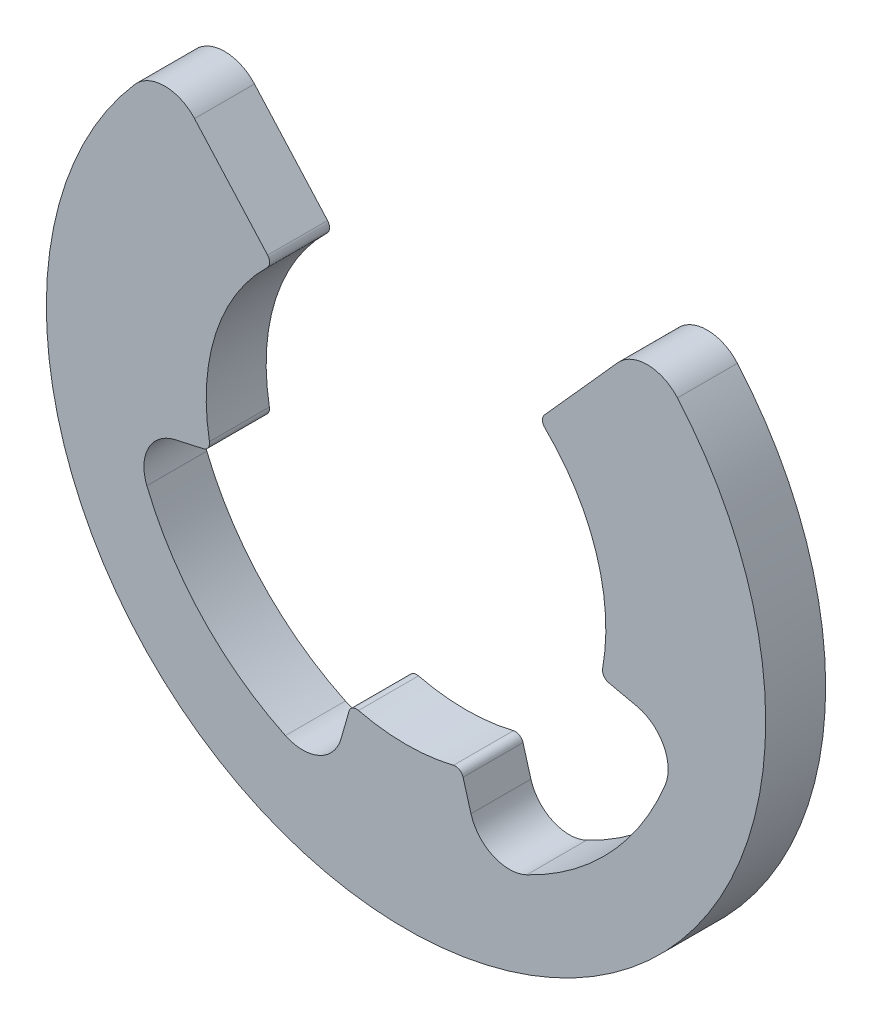
ISO-10303-21;
HEADER;
FILE_DESCRIPTION(('STEP AP214'),'2;1');
FILE_NAME('part.step','',(''),(''),'','','');
FILE_SCHEMA(('AUTOMOTIVE_DESIGN { 1 0 10303 214 1 1 1 1 }'));
ENDSEC;
DATA;
#1=APPLICATION_CONTEXT('core data for automotive mechanical design processes');
#2=APPLICATION_PROTOCOL_DEFINITION('international standard','automotive_design',2000,#1);
#3=PRODUCT_CONTEXT('',#1,'mechanical');
#4=PRODUCT('Part','Part','',(#3));
#5=PRODUCT_RELATED_PRODUCT_CATEGORY('part','',(#4));
#6=PRODUCT_DEFINITION_FORMATION('','',#4);
#7=PRODUCT_DEFINITION_CONTEXT('part definition',#1,'design');
#8=PRODUCT_DEFINITION('design','',#6,#7);
#9=PRODUCT_DEFINITION_SHAPE('','',#8);
#10=(LENGTH_UNIT() NAMED_UNIT(*) SI_UNIT(.MILLI.,.METRE.));
#11=(NAMED_UNIT(*) PLANE_ANGLE_UNIT() SI_UNIT($,.RADIAN.));
#12=(NAMED_UNIT(*) SI_UNIT($,.STERADIAN.) SOLID_ANGLE_UNIT());
#13=UNCERTAINTY_MEASURE_WITH_UNIT(LENGTH_MEASURE(1.E-05),#10,'distance_accuracy_value','');
#14=(GEOMETRIC_REPRESENTATION_CONTEXT(3) GLOBAL_UNCERTAINTY_ASSIGNED_CONTEXT((#13)) GLOBAL_UNIT_ASSIGNED_CONTEXT((#10,
#11,#12)) REPRESENTATION_CONTEXT('',''));
#15=CARTESIAN_POINT('',(0.,0.,0.));
#16=DIRECTION('',(0.,0.,1.));
#17=DIRECTION('',(1.,0.,0.));
#18=AXIS2_PLACEMENT_3D('',#15,#16,#17);
#19=CARTESIAN_POINT('',(3.01842930731455,2.62470655821647,0.75));
#20=DIRECTION('',(0.,0.,-1.));
#21=DIRECTION('',(-1.,0.,0.));
#22=AXIS2_PLACEMENT_3D('',#19,#20,#21);
#23=CYLINDRICAL_SURFACE('',#22,0.500000000000001);
#24=CARTESIAN_POINT('',(3.01842930731455,2.62470655821647,0.));
#25=DIRECTION('',(0.,0.,1.));
#26=DIRECTION('',(-1.,0.,0.));
#27=AXIS2_PLACEMENT_3D('',#24,#25,#26);
#28=CIRCLE('',#27,0.500000000000001);
#29=CARTESIAN_POINT('',(3.39573297072888,2.95279487799353,0.));
#30=VERTEX_POINT('',#29);
#31=CARTESIAN_POINT('',(2.64575131106459,2.95803989154981,0.));
#32=VERTEX_POINT('',#31);
#33=EDGE_CURVE('E229',#30,#32,#28,.T.);
#34=ORIENTED_EDGE('',*,*,#33,.T.);
#35=DIRECTION('',(0.,0.,-1.));
#36=VECTOR('',#35,1.);
#37=CARTESIAN_POINT('',(2.64575131106459,2.95803989154981,0.75));
#38=LINE('',#37,#36);
#39=CARTESIAN_POINT('',(2.64575131106459,2.95803989154981,0.75));
#40=VERTEX_POINT('',#39);
#41=EDGE_CURVE('E11',#40,#32,#38,.T.);
#42=ORIENTED_EDGE('',*,*,#41,.F.);
#43=CARTESIAN_POINT('',(3.01842930731455,2.62470655821647,0.75));
#44=DIRECTION('',(0.,0.,1.));
#45=DIRECTION('',(-1.,0.,0.));
#46=AXIS2_PLACEMENT_3D('',#43,#44,#45);
#47=CIRCLE('',#46,0.500000000000001);
#48=CARTESIAN_POINT('',(3.39573297072888,2.95279487799353,0.75));
#49=VERTEX_POINT('',#48);
#50=EDGE_CURVE('E275',#49,#40,#47,.T.);
#51=ORIENTED_EDGE('',*,*,#50,.F.);
#52=DIRECTION('',(0.,0.,-1.));
#53=VECTOR('',#52,1.);
#54=CARTESIAN_POINT('',(3.39573297072888,2.95279487799353,0.75));
#55=LINE('',#54,#53);
#56=EDGE_CURVE('E225',#49,#30,#55,.T.);
#57=ORIENTED_EDGE('',*,*,#56,.T.);
#58=EDGE_LOOP('',(#34,#42,#51,#57));
#59=FACE_BOUND('',#58,.T.);
#60=ADVANCED_FACE('F37',(#59),#23,.T.);
#61=CARTESIAN_POINT('',(2.64575131106459,2.95803989154981,0.75));
#62=DIRECTION('',(0.745355992499929,-0.666666666666667,0.));
#63=DIRECTION('',(0.666666666666667,0.74535599249993,0.));
#64=AXIS2_PLACEMENT_3D('',#61,#62,#63);
#65=PLANE('',#64);
#66=DIRECTION('',(-0.666666666666667,-0.74535599249993,0.));
#67=VECTOR('',#66,1.);
#68=CARTESIAN_POINT('',(2.64575131106459,2.95803989154981,0.));
#69=LINE('',#68,#67);
#70=CARTESIAN_POINT('',(1.73205080756888,1.93649167310371,0.));
#71=VERTEX_POINT('',#70);
#72=EDGE_CURVE('E232',#32,#71,#69,.T.);
#73=ORIENTED_EDGE('',*,*,#72,.T.);
#74=DIRECTION('',(0.,0.,-1.));
#75=VECTOR('',#74,1.);
#76=CARTESIAN_POINT('',(1.73205080756888,1.93649167310371,0.75));
#77=LINE('',#76,#75);
#78=CARTESIAN_POINT('',(1.73205080756888,1.93649167310371,0.75));
#79=VERTEX_POINT('',#78);
#80=EDGE_CURVE('E45',#79,#71,#77,.T.);
#81=ORIENTED_EDGE('',*,*,#80,.F.);
#82=DIRECTION('',(-0.666666666666667,-0.74535599249993,0.));
#83=VECTOR('',#82,1.);
#84=CARTESIAN_POINT('',(2.64575131106459,2.95803989154981,0.75));
#85=LINE('',#84,#83);
#86=EDGE_CURVE('E144',#40,#79,#85,.T.);
#87=ORIENTED_EDGE('',*,*,#86,.F.);
#88=ORIENTED_EDGE('',*,*,#41,.T.);
#89=EDGE_LOOP('',(#73,#81,#87,#88));
#90=FACE_BOUND('',#89,.T.);
#91=ADVANCED_FACE('F413',(#90),#65,.F.);
#92=CARTESIAN_POINT('',(1.80658640681887,1.86982500643704,0.75));
#93=DIRECTION('',(0.,0.,-1.));
#94=DIRECTION('',(-1.,0.,0.));
#95=AXIS2_PLACEMENT_3D('',#92,#93,#94);
#96=CYLINDRICAL_SURFACE('',#95,0.1);
#97=CARTESIAN_POINT('',(1.80658640681887,1.86982500643704,0.));
#98=DIRECTION('',(0.,0.,1.));
#99=DIRECTION('',(-1.,0.,0.));
#100=AXIS2_PLACEMENT_3D('',#97,#98,#99);
#101=CIRCLE('',#100,0.1);
#102=CARTESIAN_POINT('',(1.73710231424891,1.79790866003562,0.));
#103=VERTEX_POINT('',#102);
#104=EDGE_CURVE('E234',#71,#103,#101,.T.);
#105=ORIENTED_EDGE('',*,*,#104,.T.);
#106=DIRECTION('',(0.,0.,-1.));
#107=VECTOR('',#106,1.);
#108=CARTESIAN_POINT('',(1.73710231424891,1.79790866003562,0.75));
#109=LINE('',#108,#107);
#110=CARTESIAN_POINT('',(1.73710231424891,1.79790866003562,0.75));
#111=VERTEX_POINT('',#110);
#112=EDGE_CURVE('E330',#111,#103,#109,.T.);
#113=ORIENTED_EDGE('',*,*,#112,.F.);
#114=CARTESIAN_POINT('',(1.80658640681887,1.86982500643704,0.75));
#115=DIRECTION('',(0.,0.,1.));
#116=DIRECTION('',(-1.,0.,0.));
#117=AXIS2_PLACEMENT_3D('',#114,#115,#116);
#118=CIRCLE('',#117,0.1);
#119=EDGE_CURVE('E338',#79,#111,#118,.T.);
#120=ORIENTED_EDGE('',*,*,#119,.F.);
#121=ORIENTED_EDGE('',*,*,#80,.T.);
#122=EDGE_LOOP('',(#105,#113,#120,#121));
#123=FACE_BOUND('',#122,.T.);
#124=ADVANCED_FACE('F336',(#123),#96,.T.);
#125=CARTESIAN_POINT('',(0.,0.,0.75));
#126=DIRECTION('',(0.,0.,-1.));
#127=DIRECTION('',(-1.,0.,0.));
#128=AXIS2_PLACEMENT_3D('',#125,#126,#127);
#129=CYLINDRICAL_SURFACE('',#128,2.5);
#130=CARTESIAN_POINT('',(0.,0.,0.));
#131=DIRECTION('',(0.,0.,-1.));
#132=DIRECTION('',(1.,0.,0.));
#133=AXIS2_PLACEMENT_3D('',#130,#131,#132);
#134=CIRCLE('',#133,2.5);
#135=CARTESIAN_POINT('',(2.45952060065069,-0.448060726882923,0.));
#136=VERTEX_POINT('',#135);
#137=EDGE_CURVE('E236',#103,#136,#134,.T.);
#138=ORIENTED_EDGE('',*,*,#137,.T.);
#139=DIRECTION('',(0.,0.,-1.));
#140=VECTOR('',#139,1.);
#141=CARTESIAN_POINT('',(2.45952060065069,-0.448060726882923,0.75));
#142=LINE('',#141,#140);
#143=CARTESIAN_POINT('',(2.45952060065069,-0.448060726882923,0.75));
#144=VERTEX_POINT('',#143);
#145=EDGE_CURVE('E327',#144,#136,#142,.T.);
#146=ORIENTED_EDGE('',*,*,#145,.F.);
#147=CARTESIAN_POINT('',(0.,0.,0.75));
#148=DIRECTION('',(0.,0.,-1.));
#149=DIRECTION('',(1.,0.,0.));
#150=AXIS2_PLACEMENT_3D('',#147,#148,#149);
#151=CIRCLE('',#150,2.5);
#152=EDGE_CURVE('E356',#111,#144,#151,.T.);
#153=ORIENTED_EDGE('',*,*,#152,.F.);
#154=ORIENTED_EDGE('',*,*,#112,.T.);
#155=EDGE_LOOP('',(#138,#146,#153,#154));
#156=FACE_BOUND('',#155,.T.);
#157=ADVANCED_FACE('F347',(#156),#129,.F.);
#158=CARTESIAN_POINT('',(2.55790142467672,-0.465983155958239,0.75));
#159=DIRECTION('',(0.,0.,-1.));
#160=DIRECTION('',(-1.,0.,0.));
#161=AXIS2_PLACEMENT_3D('',#158,#159,#160);
#162=CYLINDRICAL_SURFACE('',#161,0.0999999999999998);
#163=CARTESIAN_POINT('',(2.55790142467672,-0.465983155958239,0.));
#164=DIRECTION('',(0.,0.,1.));
#165=DIRECTION('',(1.,0.,0.));
#166=AXIS2_PLACEMENT_3D('',#163,#164,#165);
#167=CIRCLE('',#166,0.0999999999999998);
#168=CARTESIAN_POINT('',(2.53620837889485,-0.563601861976634,0.));
#169=VERTEX_POINT('',#168);
#170=EDGE_CURVE('E238',#136,#169,#167,.T.);
#171=ORIENTED_EDGE('',*,*,#170,.T.);
#172=DIRECTION('',(0.,0.,-1.));
#173=VECTOR('',#172,1.);
#174=CARTESIAN_POINT('',(2.53620837889485,-0.563601861976634,0.75));
#175=LINE('',#174,#173);
#176=CARTESIAN_POINT('',(2.53620837889485,-0.563601861976634,0.75));
#177=VERTEX_POINT('',#176);
#178=EDGE_CURVE('E324',#177,#169,#175,.T.);
#179=ORIENTED_EDGE('',*,*,#178,.F.);
#180=CARTESIAN_POINT('',(2.55790142467672,-0.465983155958239,0.75));
#181=DIRECTION('',(0.,0.,1.));
#182=DIRECTION('',(1.,0.,0.));
#183=AXIS2_PLACEMENT_3D('',#180,#181,#182);
#184=CIRCLE('',#183,0.0999999999999998);
#185=EDGE_CURVE('E353',#144,#177,#184,.T.);
#186=ORIENTED_EDGE('',*,*,#185,.F.);
#187=ORIENTED_EDGE('',*,*,#145,.T.);
#188=EDGE_LOOP('',(#171,#179,#186,#187));
#189=FACE_BOUND('',#188,.T.);
#190=ADVANCED_FACE('F351',(#189),#162,.T.);
#191=CARTESIAN_POINT('',(2.88760026563887,-0.641688947919748,0.75));
#192=DIRECTION('',(0.216930457818656,0.976187060183953,0.));
#193=DIRECTION('',(-0.976187060183953,0.216930457818656,0.));
#194=AXIS2_PLACEMENT_3D('',#191,#192,#193);
#195=PLANE('',#194);
#196=DIRECTION('',(0.976187060183953,-0.216930457818656,0.));
#197=VECTOR('',#196,1.);
#198=CARTESIAN_POINT('',(2.88760026563887,-0.641688947919748,0.));
#199=LINE('',#198,#197);
#200=CARTESIAN_POINT('',(2.88760026563887,-0.641688947919748,0.));
#201=VERTEX_POINT('',#200);
#202=EDGE_CURVE('E240',#169,#201,#199,.T.);
#203=ORIENTED_EDGE('',*,*,#202,.T.);
#204=DIRECTION('',(0.,0.,-1.));
#205=VECTOR('',#204,1.);
#206=CARTESIAN_POINT('',(2.88760026563887,-0.641688947919748,0.75));
#207=LINE('',#206,#205);
#208=CARTESIAN_POINT('',(2.88760026563887,-0.641688947919748,0.75));
#209=VERTEX_POINT('',#208);
#210=EDGE_CURVE('E321',#209,#201,#207,.T.);
#211=ORIENTED_EDGE('',*,*,#210,.F.);
#212=DIRECTION('',(0.976187060183953,-0.216930457818656,0.));
#213=VECTOR('',#212,1.);
#214=CARTESIAN_POINT('',(2.88760026563887,-0.641688947919748,0.75));
#215=LINE('',#214,#213);
#216=EDGE_CURVE('E355',#177,#209,#215,.T.);
#217=ORIENTED_EDGE('',*,*,#216,.F.);
#218=ORIENTED_EDGE('',*,*,#178,.T.);
#219=EDGE_LOOP('',(#203,#211,#217,#218));
#220=FACE_BOUND('',#219,.T.);
#221=ADVANCED_FACE('F426',(#220),#195,.F.);
#222=CARTESIAN_POINT('',(2.77913503672954,-1.12978247801172,0.75));
#223=DIRECTION('',(0.,0.,-1.));
#224=DIRECTION('',(-1.,0.,0.));
#225=AXIS2_PLACEMENT_3D('',#222,#223,#224);
#226=CYLINDRICAL_SURFACE('',#225,0.5);
#227=CARTESIAN_POINT('',(2.77913503672954,-1.12978247801172,0.));
#228=DIRECTION('',(0.,0.,-1.));
#229=DIRECTION('',(1.,0.,0.));
#230=AXIS2_PLACEMENT_3D('',#227,#228,#229);
#231=CIRCLE('',#230,0.5);
#232=CARTESIAN_POINT('',(3.24232420951779,-1.31807955768035,0.));
#233=VERTEX_POINT('',#232);
#234=EDGE_CURVE('E242',#201,#233,#231,.T.);
#235=ORIENTED_EDGE('',*,*,#234,.T.);
#236=DIRECTION('',(0.,0.,-1.));
#237=VECTOR('',#236,1.);
#238=CARTESIAN_POINT('',(3.24232420951779,-1.31807955768035,0.75));
#239=LINE('',#238,#237);
#240=CARTESIAN_POINT('',(3.24232420951779,-1.31807955768035,0.75));
#241=VERTEX_POINT('',#240);
#242=EDGE_CURVE('E318',#241,#233,#239,.T.);
#243=ORIENTED_EDGE('',*,*,#242,.F.);
#244=CARTESIAN_POINT('',(2.77913503672954,-1.12978247801172,0.75));
#245=DIRECTION('',(0.,0.,-1.));
#246=DIRECTION('',(1.,0.,0.));
#247=AXIS2_PLACEMENT_3D('',#244,#245,#246);
#248=CIRCLE('',#247,0.5);
#249=EDGE_CURVE('E358',#209,#241,#248,.T.);
#250=ORIENTED_EDGE('',*,*,#249,.F.);
#251=ORIENTED_EDGE('',*,*,#210,.T.);
#252=EDGE_LOOP('',(#235,#243,#250,#251));
#253=FACE_BOUND('',#252,.T.);
#254=ADVANCED_FACE('F429',(#253),#226,.F.);
#255=CARTESIAN_POINT('',(0.,0.,0.75));
#256=DIRECTION('',(0.,0.,-1.));
#257=DIRECTION('',(-1.,0.,0.));
#258=AXIS2_PLACEMENT_3D('',#255,#256,#257);
#259=CYLINDRICAL_SURFACE('',#258,3.5);
#260=CARTESIAN_POINT('',(0.,0.,0.));
#261=DIRECTION('',(0.,0.,-1.));
#262=DIRECTION('',(1.,0.,0.));
#263=AXIS2_PLACEMENT_3D('',#260,#261,#262);
#264=CIRCLE('',#263,3.5);
#265=CARTESIAN_POINT('',(1.50896436739115,-3.15800990149553,0.));
#266=VERTEX_POINT('',#265);
#267=EDGE_CURVE('E244',#233,#266,#264,.T.);
#268=ORIENTED_EDGE('',*,*,#267,.T.);
#269=DIRECTION('',(0.,0.,-1.));
#270=VECTOR('',#269,1.);
#271=CARTESIAN_POINT('',(1.50896436739115,-3.15800990149553,0.75));
#272=LINE('',#271,#270);
#273=CARTESIAN_POINT('',(1.50896436739115,-3.15800990149553,0.75));
#274=VERTEX_POINT('',#273);
#275=EDGE_CURVE('E315',#274,#266,#272,.T.);
#276=ORIENTED_EDGE('',*,*,#275,.F.);
#277=CARTESIAN_POINT('',(0.,0.,0.75));
#278=DIRECTION('',(0.,0.,-1.));
#279=DIRECTION('',(1.,0.,0.));
#280=AXIS2_PLACEMENT_3D('',#277,#278,#279);
#281=CIRCLE('',#280,3.5);
#282=EDGE_CURVE('E364',#241,#274,#281,.T.);
#283=ORIENTED_EDGE('',*,*,#282,.F.);
#284=ORIENTED_EDGE('',*,*,#242,.T.);
#285=EDGE_LOOP('',(#268,#276,#283,#284));
#286=FACE_BOUND('',#285,.T.);
#287=ADVANCED_FACE('F433',(#286),#259,.F.);
#288=CARTESIAN_POINT('',(1.29339802919241,-2.70686562985331,0.75));
#289=DIRECTION('',(0.,0.,-1.));
#290=DIRECTION('',(-1.,0.,0.));
#291=AXIS2_PLACEMENT_3D('',#288,#289,#290);
#292=CYLINDRICAL_SURFACE('',#291,0.5);
#293=CARTESIAN_POINT('',(1.29339802919241,-2.70686562985331,0.));
#294=DIRECTION('',(0.,0.,-1.));
#295=DIRECTION('',(-1.,0.,0.));
#296=AXIS2_PLACEMENT_3D('',#293,#294,#295);
#297=CIRCLE('',#296,0.5);
#298=CARTESIAN_POINT('',(0.812636055372002,-2.844226193802,0.));
#299=VERTEX_POINT('',#298);
#300=EDGE_CURVE('E246',#266,#299,#297,.T.);
#301=ORIENTED_EDGE('',*,*,#300,.T.);
#302=DIRECTION('',(0.,0.,-1.));
#303=VECTOR('',#302,1.);
#304=CARTESIAN_POINT('',(0.812636055372002,-2.844226193802,0.75));
#305=LINE('',#304,#303);
#306=CARTESIAN_POINT('',(0.812636055372002,-2.844226193802,0.75));
#307=VERTEX_POINT('',#306);
#308=EDGE_CURVE('E312',#307,#299,#305,.T.);
#309=ORIENTED_EDGE('',*,*,#308,.F.);
#310=CARTESIAN_POINT('',(1.29339802919241,-2.70686562985331,0.75));
#311=DIRECTION('',(0.,0.,-1.));
#312=DIRECTION('',(-1.,0.,0.));
#313=AXIS2_PLACEMENT_3D('',#310,#311,#312);
#314=CIRCLE('',#313,0.5);
#315=EDGE_CURVE('E366',#274,#307,#314,.T.);
#316=ORIENTED_EDGE('',*,*,#315,.F.);
#317=ORIENTED_EDGE('',*,*,#275,.T.);
#318=EDGE_LOOP('',(#301,#309,#316,#317));
#319=FACE_BOUND('',#318,.T.);
#320=ADVANCED_FACE('F437',(#319),#292,.F.);
#321=CARTESIAN_POINT('',(0.71374642714633,-2.49811249501215,0.75));
#322=DIRECTION('',(-0.961523947640823,-0.274721127897378,0.));
#323=DIRECTION('',(0.274721127897378,-0.961523947640823,0.));
#324=AXIS2_PLACEMENT_3D('',#321,#322,#323);
#325=PLANE('',#324);
#326=DIRECTION('',(-0.274721127897378,0.961523947640823,0.));
#327=VECTOR('',#326,1.);
#328=CARTESIAN_POINT('',(0.71374642714633,-2.49811249501215,0.));
#329=LINE('',#328,#327);
#330=CARTESIAN_POINT('',(0.71374642714633,-2.49811249501215,0.));
#331=VERTEX_POINT('',#330);
#332=EDGE_CURVE('E248',#299,#331,#329,.T.);
#333=ORIENTED_EDGE('',*,*,#332,.T.);
#334=DIRECTION('',(0.,0.,-1.));
#335=VECTOR('',#334,1.);
#336=CARTESIAN_POINT('',(0.71374642714633,-2.49811249501215,0.75));
#337=LINE('',#336,#335);
#338=CARTESIAN_POINT('',(0.71374642714633,-2.49811249501215,0.75));
#339=VERTEX_POINT('',#338);
#340=EDGE_CURVE('E309',#339,#331,#337,.T.);
#341=ORIENTED_EDGE('',*,*,#340,.F.);
#342=DIRECTION('',(-0.274721127897378,0.961523947640823,0.));
#343=VECTOR('',#342,1.);
#344=CARTESIAN_POINT('',(0.71374642714633,-2.49811249501215,0.75));
#345=LINE('',#344,#343);
#346=EDGE_CURVE('E368',#307,#339,#345,.T.);
#347=ORIENTED_EDGE('',*,*,#346,.F.);
#348=ORIENTED_EDGE('',*,*,#308,.T.);
#349=EDGE_LOOP('',(#333,#341,#347,#348));
#350=FACE_BOUND('',#349,.T.);
#351=ADVANCED_FACE('F441',(#350),#325,.F.);
#352=CARTESIAN_POINT('',(0.617594032382247,-2.52558460780189,0.75));
#353=DIRECTION('',(0.,0.,-1.));
#354=DIRECTION('',(-1.,0.,0.));
#355=AXIS2_PLACEMENT_3D('',#352,#353,#354);
#356=CYLINDRICAL_SURFACE('',#355,0.1);
#357=CARTESIAN_POINT('',(0.617594032382247,-2.52558460780189,0.));
#358=DIRECTION('',(0.,0.,1.));
#359=DIRECTION('',(-1.,0.,0.));
#360=AXIS2_PLACEMENT_3D('',#357,#358,#359);
#361=CIRCLE('',#360,0.1);
#362=CARTESIAN_POINT('',(0.593840415752161,-2.42844673827105,0.));
#363=VERTEX_POINT('',#362);
#364=EDGE_CURVE('E250',#331,#363,#361,.T.);
#365=ORIENTED_EDGE('',*,*,#364,.T.);
#366=DIRECTION('',(0.,0.,-1.));
#367=VECTOR('',#366,1.);
#368=CARTESIAN_POINT('',(0.593840415752161,-2.42844673827105,0.75));
#369=LINE('',#368,#367);
#370=CARTESIAN_POINT('',(0.593840415752161,-2.42844673827105,0.75));
#371=VERTEX_POINT('',#370);
#372=EDGE_CURVE('E306',#371,#363,#369,.T.);
#373=ORIENTED_EDGE('',*,*,#372,.F.);
#374=CARTESIAN_POINT('',(0.617594032382247,-2.52558460780189,0.75));
#375=DIRECTION('',(0.,0.,1.));
#376=DIRECTION('',(-1.,0.,0.));
#377=AXIS2_PLACEMENT_3D('',#374,#375,#376);
#378=CIRCLE('',#377,0.1);
#379=EDGE_CURVE('E370',#339,#371,#378,.T.);
#380=ORIENTED_EDGE('',*,*,#379,.F.);
#381=ORIENTED_EDGE('',*,*,#340,.T.);
#382=EDGE_LOOP('',(#365,#373,#380,#381));
#383=FACE_BOUND('',#382,.T.);
#384=ADVANCED_FACE('F445',(#383),#356,.T.);
#385=CARTESIAN_POINT('',(0.,0.,0.75));
#386=DIRECTION('',(0.,0.,-1.));
#387=DIRECTION('',(-1.,0.,0.));
#388=AXIS2_PLACEMENT_3D('',#385,#386,#387);
#389=CYLINDRICAL_SURFACE('',#388,2.5);
#390=CARTESIAN_POINT('',(0.,0.,0.));
#391=DIRECTION('',(0.,0.,-1.));
#392=DIRECTION('',(1.,0.,0.));
#393=AXIS2_PLACEMENT_3D('',#390,#391,#392);
#394=CIRCLE('',#393,2.5);
#395=CARTESIAN_POINT('',(-0.593840415752162,-2.42844673827105,0.));
#396=VERTEX_POINT('',#395);
#397=EDGE_CURVE('E252',#363,#396,#394,.T.);
#398=ORIENTED_EDGE('',*,*,#397,.T.);
#399=DIRECTION('',(0.,0.,-1.));
#400=VECTOR('',#399,1.);
#401=CARTESIAN_POINT('',(-0.593840415752162,-2.42844673827105,0.75));
#402=LINE('',#401,#400);
#403=CARTESIAN_POINT('',(-0.593840415752162,-2.42844673827105,0.75));
#404=VERTEX_POINT('',#403);
#405=EDGE_CURVE('E303',#404,#396,#402,.T.);
#406=ORIENTED_EDGE('',*,*,#405,.F.);
#407=CARTESIAN_POINT('',(0.,0.,0.75));
#408=DIRECTION('',(0.,0.,-1.));
#409=DIRECTION('',(1.,0.,0.));
#410=AXIS2_PLACEMENT_3D('',#407,#408,#409);
#411=CIRCLE('',#410,2.5);
#412=EDGE_CURVE('E372',#371,#404,#411,.T.);
#413=ORIENTED_EDGE('',*,*,#412,.F.);
#414=ORIENTED_EDGE('',*,*,#372,.T.);
#415=EDGE_LOOP('',(#398,#406,#413,#414));
#416=FACE_BOUND('',#415,.T.);
#417=ADVANCED_FACE('F449',(#416),#389,.F.);
#418=CARTESIAN_POINT('',(-0.617594032382247,-2.52558460780189,0.75));
#419=DIRECTION('',(0.,0.,-1.));
#420=DIRECTION('',(-1.,0.,0.));
#421=AXIS2_PLACEMENT_3D('',#418,#419,#420);
#422=CYLINDRICAL_SURFACE('',#421,0.1);
#423=CARTESIAN_POINT('',(-0.617594032382247,-2.52558460780189,0.));
#424=DIRECTION('',(0.,0.,1.));
#425=DIRECTION('',(1.,0.,0.));
#426=AXIS2_PLACEMENT_3D('',#423,#424,#425);
#427=CIRCLE('',#426,0.1);
#428=CARTESIAN_POINT('',(-0.71374642714633,-2.49811249501215,0.));
#429=VERTEX_POINT('',#428);
#430=EDGE_CURVE('E254',#396,#429,#427,.T.);
#431=ORIENTED_EDGE('',*,*,#430,.T.);
#432=DIRECTION('',(0.,0.,-1.));
#433=VECTOR('',#432,1.);
#434=CARTESIAN_POINT('',(-0.71374642714633,-2.49811249501215,0.75));
#435=LINE('',#434,#433);
#436=CARTESIAN_POINT('',(-0.71374642714633,-2.49811249501215,0.75));
#437=VERTEX_POINT('',#436);
#438=EDGE_CURVE('E300',#437,#429,#435,.T.);
#439=ORIENTED_EDGE('',*,*,#438,.F.);
#440=CARTESIAN_POINT('',(-0.617594032382247,-2.52558460780189,0.75));
#441=DIRECTION('',(0.,0.,1.));
#442=DIRECTION('',(1.,0.,0.));
#443=AXIS2_PLACEMENT_3D('',#440,#441,#442);
#444=CIRCLE('',#443,0.1);
#445=EDGE_CURVE('E374',#404,#437,#444,.T.);
#446=ORIENTED_EDGE('',*,*,#445,.F.);
#447=ORIENTED_EDGE('',*,*,#405,.T.);
#448=EDGE_LOOP('',(#431,#439,#446,#447));
#449=FACE_BOUND('',#448,.T.);
#450=ADVANCED_FACE('F453',(#449),#422,.T.);
#451=CARTESIAN_POINT('',(-0.71374642714633,-2.49811249501215,0.75));
#452=DIRECTION('',(0.961523947640823,-0.274721127897378,0.));
#453=DIRECTION('',(0.274721127897378,0.961523947640823,0.));
#454=AXIS2_PLACEMENT_3D('',#451,#452,#453);
#455=PLANE('',#454);
#456=DIRECTION('',(-0.274721127897378,-0.961523947640823,0.));
#457=VECTOR('',#456,1.);
#458=CARTESIAN_POINT('',(-0.71374642714633,-2.49811249501215,0.));
#459=LINE('',#458,#457);
#460=CARTESIAN_POINT('',(-0.812636055372001,-2.844226193802,0.));
#461=VERTEX_POINT('',#460);
#462=EDGE_CURVE('E256',#429,#461,#459,.T.);
#463=ORIENTED_EDGE('',*,*,#462,.T.);
#464=DIRECTION('',(0.,0.,-1.));
#465=VECTOR('',#464,1.);
#466=CARTESIAN_POINT('',(-0.812636055372001,-2.844226193802,0.75));
#467=LINE('',#466,#465);
#468=CARTESIAN_POINT('',(-0.812636055372001,-2.844226193802,0.75));
#469=VERTEX_POINT('',#468);
#470=EDGE_CURVE('E297',#469,#461,#467,.T.);
#471=ORIENTED_EDGE('',*,*,#470,.F.);
#472=DIRECTION('',(-0.274721127897378,-0.961523947640823,0.));
#473=VECTOR('',#472,1.);
#474=CARTESIAN_POINT('',(-0.71374642714633,-2.49811249501215,0.75));
#475=LINE('',#474,#473);
#476=EDGE_CURVE('E376',#437,#469,#475,.T.);
#477=ORIENTED_EDGE('',*,*,#476,.F.);
#478=ORIENTED_EDGE('',*,*,#438,.T.);
#479=EDGE_LOOP('',(#463,#471,#477,#478));
#480=FACE_BOUND('',#479,.T.);
#481=ADVANCED_FACE('F457',(#480),#455,.F.);
#482=CARTESIAN_POINT('',(-1.29339802919241,-2.70686562985331,0.75));
#483=DIRECTION('',(0.,0.,-1.));
#484=DIRECTION('',(-1.,0.,0.));
#485=AXIS2_PLACEMENT_3D('',#482,#483,#484);
#486=CYLINDRICAL_SURFACE('',#485,0.5);
#487=CARTESIAN_POINT('',(-1.29339802919241,-2.70686562985331,0.));
#488=DIRECTION('',(0.,0.,-1.));
#489=DIRECTION('',(1.,0.,0.));
#490=AXIS2_PLACEMENT_3D('',#487,#488,#489);
#491=CIRCLE('',#490,0.5);
#492=CARTESIAN_POINT('',(-1.50896436739115,-3.15800990149553,0.));
#493=VERTEX_POINT('',#492);
#494=EDGE_CURVE('E258',#461,#493,#491,.T.);
#495=ORIENTED_EDGE('',*,*,#494,.T.);
#496=DIRECTION('',(0.,0.,-1.));
#497=VECTOR('',#496,1.);
#498=CARTESIAN_POINT('',(-1.50896436739115,-3.15800990149553,0.75));
#499=LINE('',#498,#497);
#500=CARTESIAN_POINT('',(-1.50896436739115,-3.15800990149553,0.75));
#501=VERTEX_POINT('',#500);
#502=EDGE_CURVE('E294',#501,#493,#499,.T.);
#503=ORIENTED_EDGE('',*,*,#502,.F.);
#504=CARTESIAN_POINT('',(-1.29339802919241,-2.70686562985331,0.75));
#505=DIRECTION('',(0.,0.,-1.));
#506=DIRECTION('',(1.,0.,0.));
#507=AXIS2_PLACEMENT_3D('',#504,#505,#506);
#508=CIRCLE('',#507,0.5);
#509=EDGE_CURVE('E378',#469,#501,#508,.T.);
#510=ORIENTED_EDGE('',*,*,#509,.F.);
#511=ORIENTED_EDGE('',*,*,#470,.T.);
#512=EDGE_LOOP('',(#495,#503,#510,#511));
#513=FACE_BOUND('',#512,.T.);
#514=ADVANCED_FACE('F461',(#513),#486,.F.);
#515=CARTESIAN_POINT('',(0.,0.,0.75));
#516=DIRECTION('',(0.,0.,-1.));
#517=DIRECTION('',(-1.,0.,0.));
#518=AXIS2_PLACEMENT_3D('',#515,#516,#517);
#519=CYLINDRICAL_SURFACE('',#518,3.5);
#520=CARTESIAN_POINT('',(0.,0.,0.));
#521=DIRECTION('',(0.,0.,-1.));
#522=DIRECTION('',(1.,0.,0.));
#523=AXIS2_PLACEMENT_3D('',#520,#521,#522);
#524=CIRCLE('',#523,3.5);
#525=CARTESIAN_POINT('',(-3.24232420951779,-1.31807955768034,0.));
#526=VERTEX_POINT('',#525);
#527=EDGE_CURVE('E260',#493,#526,#524,.T.);
#528=ORIENTED_EDGE('',*,*,#527,.T.);
#529=DIRECTION('',(0.,0.,-1.));
#530=VECTOR('',#529,1.);
#531=CARTESIAN_POINT('',(-3.24232420951779,-1.31807955768034,0.75));
#532=LINE('',#531,#530);
#533=CARTESIAN_POINT('',(-3.24232420951779,-1.31807955768034,0.75));
#534=VERTEX_POINT('',#533);
#535=EDGE_CURVE('E291',#534,#526,#532,.T.);
#536=ORIENTED_EDGE('',*,*,#535,.F.);
#537=CARTESIAN_POINT('',(0.,0.,0.75));
#538=DIRECTION('',(0.,0.,-1.));
#539=DIRECTION('',(1.,0.,0.));
#540=AXIS2_PLACEMENT_3D('',#537,#538,#539);
#541=CIRCLE('',#540,3.5);
#542=EDGE_CURVE('E380',#501,#534,#541,.T.);
#543=ORIENTED_EDGE('',*,*,#542,.F.);
#544=ORIENTED_EDGE('',*,*,#502,.T.);
#545=EDGE_LOOP('',(#528,#536,#543,#544));
#546=FACE_BOUND('',#545,.T.);
#547=ADVANCED_FACE('F465',(#546),#519,.F.);
#548=CARTESIAN_POINT('',(-2.77913503672954,-1.12978247801172,0.75));
#549=DIRECTION('',(0.,0.,-1.));
#550=DIRECTION('',(-1.,0.,0.));
#551=AXIS2_PLACEMENT_3D('',#548,#549,#550);
#552=CYLINDRICAL_SURFACE('',#551,0.5);
#553=CARTESIAN_POINT('',(-2.77913503672954,-1.12978247801172,0.));
#554=DIRECTION('',(0.,0.,-1.));
#555=DIRECTION('',(-1.,0.,0.));
#556=AXIS2_PLACEMENT_3D('',#553,#554,#555);
#557=CIRCLE('',#556,0.5);
#558=CARTESIAN_POINT('',(-2.88760026563887,-0.641688947919749,0.));
#559=VERTEX_POINT('',#558);
#560=EDGE_CURVE('E262',#526,#559,#557,.T.);
#561=ORIENTED_EDGE('',*,*,#560,.T.);
#562=DIRECTION('',(0.,0.,-1.));
#563=VECTOR('',#562,1.);
#564=CARTESIAN_POINT('',(-2.88760026563887,-0.641688947919749,0.75));
#565=LINE('',#564,#563);
#566=CARTESIAN_POINT('',(-2.88760026563887,-0.641688947919749,0.75));
#567=VERTEX_POINT('',#566);
#568=EDGE_CURVE('E288',#567,#559,#565,.T.);
#569=ORIENTED_EDGE('',*,*,#568,.F.);
#570=CARTESIAN_POINT('',(-2.77913503672954,-1.12978247801172,0.75));
#571=DIRECTION('',(0.,0.,-1.));
#572=DIRECTION('',(-1.,0.,0.));
#573=AXIS2_PLACEMENT_3D('',#570,#571,#572);
#574=CIRCLE('',#573,0.5);
#575=EDGE_CURVE('E382',#534,#567,#574,.T.);
#576=ORIENTED_EDGE('',*,*,#575,.F.);
#577=ORIENTED_EDGE('',*,*,#535,.T.);
#578=EDGE_LOOP('',(#561,#569,#576,#577));
#579=FACE_BOUND('',#578,.T.);
#580=ADVANCED_FACE('F469',(#579),#552,.F.);
#581=CARTESIAN_POINT('',(-2.88760026563887,-0.641688947919748,0.75));
#582=DIRECTION('',(-0.216930457818656,0.976187060183953,0.));
#583=DIRECTION('',(-0.976187060183953,-0.216930457818656,0.));
#584=AXIS2_PLACEMENT_3D('',#581,#582,#583);
#585=PLANE('',#584);
#586=DIRECTION('',(0.976187060183953,0.216930457818656,0.));
#587=VECTOR('',#586,1.);
#588=CARTESIAN_POINT('',(-2.88760026563887,-0.641688947919748,0.));
#589=LINE('',#588,#587);
#590=CARTESIAN_POINT('',(-2.53620837889485,-0.563601861976634,0.));
#591=VERTEX_POINT('',#590);
#592=EDGE_CURVE('E264',#559,#591,#589,.T.);
#593=ORIENTED_EDGE('',*,*,#592,.T.);
#594=DIRECTION('',(0.,0.,-1.));
#595=VECTOR('',#594,1.);
#596=CARTESIAN_POINT('',(-2.53620837889485,-0.563601861976634,0.75));
#597=LINE('',#596,#595);
#598=CARTESIAN_POINT('',(-2.53620837889485,-0.563601861976634,0.75));
#599=VERTEX_POINT('',#598);
#600=EDGE_CURVE('E285',#599,#591,#597,.T.);
#601=ORIENTED_EDGE('',*,*,#600,.F.);
#602=DIRECTION('',(0.976187060183953,0.216930457818656,0.));
#603=VECTOR('',#602,1.);
#604=CARTESIAN_POINT('',(-2.88760026563887,-0.641688947919748,0.75));
#605=LINE('',#604,#603);
#606=EDGE_CURVE('E384',#567,#599,#605,.T.);
#607=ORIENTED_EDGE('',*,*,#606,.F.);
#608=ORIENTED_EDGE('',*,*,#568,.T.);
#609=EDGE_LOOP('',(#593,#601,#607,#608));
#610=FACE_BOUND('',#609,.T.);
#611=ADVANCED_FACE('F473',(#610),#585,.F.);
#612=CARTESIAN_POINT('',(-2.55790142467672,-0.465983155958239,0.75));
#613=DIRECTION('',(0.,0.,-1.));
#614=DIRECTION('',(-1.,0.,0.));
#615=AXIS2_PLACEMENT_3D('',#612,#613,#614);
#616=CYLINDRICAL_SURFACE('',#615,0.0999999999999998);
#617=CARTESIAN_POINT('',(-2.55790142467672,-0.465983155958239,0.));
#618=DIRECTION('',(0.,0.,1.));
#619=DIRECTION('',(1.,0.,0.));
#620=AXIS2_PLACEMENT_3D('',#617,#618,#619);
#621=CIRCLE('',#620,0.0999999999999998);
#622=CARTESIAN_POINT('',(-2.45952060065069,-0.448060726882922,0.));
#623=VERTEX_POINT('',#622);
#624=EDGE_CURVE('E266',#591,#623,#621,.T.);
#625=ORIENTED_EDGE('',*,*,#624,.T.);
#626=DIRECTION('',(0.,0.,-1.));
#627=VECTOR('',#626,1.);
#628=CARTESIAN_POINT('',(-2.45952060065069,-0.448060726882922,0.75));
#629=LINE('',#628,#627);
#630=CARTESIAN_POINT('',(-2.45952060065069,-0.448060726882922,0.75));
#631=VERTEX_POINT('',#630);
#632=EDGE_CURVE('E282',#631,#623,#629,.T.);
#633=ORIENTED_EDGE('',*,*,#632,.F.);
#634=CARTESIAN_POINT('',(-2.55790142467672,-0.465983155958239,0.75));
#635=DIRECTION('',(0.,0.,1.));
#636=DIRECTION('',(1.,0.,0.));
#637=AXIS2_PLACEMENT_3D('',#634,#635,#636);
#638=CIRCLE('',#637,0.0999999999999998);
#639=EDGE_CURVE('E386',#599,#631,#638,.T.);
#640=ORIENTED_EDGE('',*,*,#639,.F.);
#641=ORIENTED_EDGE('',*,*,#600,.T.);
#642=EDGE_LOOP('',(#625,#633,#640,#641));
#643=FACE_BOUND('',#642,.T.);
#644=ADVANCED_FACE('F477',(#643),#616,.T.);
#645=CARTESIAN_POINT('',(0.,0.,0.75));
#646=DIRECTION('',(0.,0.,-1.));
#647=DIRECTION('',(-1.,0.,0.));
#648=AXIS2_PLACEMENT_3D('',#645,#646,#647);
#649=CYLINDRICAL_SURFACE('',#648,2.5);
#650=CARTESIAN_POINT('',(0.,0.,0.));
#651=DIRECTION('',(0.,0.,-1.));
#652=DIRECTION('',(1.,0.,0.));
#653=AXIS2_PLACEMENT_3D('',#650,#651,#652);
#654=CIRCLE('',#653,2.5);
#655=CARTESIAN_POINT('',(-1.73710231424891,1.79790866003562,0.));
#656=VERTEX_POINT('',#655);
#657=EDGE_CURVE('E268',#623,#656,#654,.T.);
#658=ORIENTED_EDGE('',*,*,#657,.T.);
#659=DIRECTION('',(0.,0.,-1.));
#660=VECTOR('',#659,1.);
#661=CARTESIAN_POINT('',(-1.73710231424891,1.79790866003562,0.75));
#662=LINE('',#661,#660);
#663=CARTESIAN_POINT('',(-1.73710231424891,1.79790866003562,0.75));
#664=VERTEX_POINT('',#663);
#665=EDGE_CURVE('E279',#664,#656,#662,.T.);
#666=ORIENTED_EDGE('',*,*,#665,.F.);
#667=CARTESIAN_POINT('',(0.,0.,0.75));
#668=DIRECTION('',(0.,0.,-1.));
#669=DIRECTION('',(1.,0.,0.));
#670=AXIS2_PLACEMENT_3D('',#667,#668,#669);
#671=CIRCLE('',#670,2.5);
#672=EDGE_CURVE('E388',#631,#664,#671,.T.);
#673=ORIENTED_EDGE('',*,*,#672,.F.);
#674=ORIENTED_EDGE('',*,*,#632,.T.);
#675=EDGE_LOOP('',(#658,#666,#673,#674));
#676=FACE_BOUND('',#675,.T.);
#677=ADVANCED_FACE('F394',(#676),#649,.F.);
#678=CARTESIAN_POINT('',(-1.80658640681887,1.86982500643704,0.75));
#679=DIRECTION('',(0.,0.,-1.));
#680=DIRECTION('',(-1.,0.,0.));
#681=AXIS2_PLACEMENT_3D('',#678,#679,#680);
#682=CYLINDRICAL_SURFACE('',#681,0.1);
#683=CARTESIAN_POINT('',(-1.80658640681887,1.86982500643704,0.));
#684=DIRECTION('',(0.,0.,1.));
#685=DIRECTION('',(1.,0.,0.));
#686=AXIS2_PLACEMENT_3D('',#683,#684,#685);
#687=CIRCLE('',#686,0.1);
#688=CARTESIAN_POINT('',(-1.73205080756888,1.93649167310371,0.));
#689=VERTEX_POINT('',#688);
#690=EDGE_CURVE('E270',#656,#689,#687,.T.);
#691=ORIENTED_EDGE('',*,*,#690,.T.);
#692=DIRECTION('',(0.,0.,-1.));
#693=VECTOR('',#692,1.);
#694=CARTESIAN_POINT('',(-1.73205080756888,1.93649167310371,0.75));
#695=LINE('',#694,#693);
#696=CARTESIAN_POINT('',(-1.73205080756888,1.93649167310371,0.75));
#697=VERTEX_POINT('',#696);
#698=EDGE_CURVE('E220',#697,#689,#695,.T.);
#699=ORIENTED_EDGE('',*,*,#698,.F.);
#700=CARTESIAN_POINT('',(-1.80658640681887,1.86982500643704,0.75));
#701=DIRECTION('',(0.,0.,1.));
#702=DIRECTION('',(1.,0.,0.));
#703=AXIS2_PLACEMENT_3D('',#700,#701,#702);
#704=CIRCLE('',#703,0.1);
#705=EDGE_CURVE('E211',#664,#697,#704,.T.);
#706=ORIENTED_EDGE('',*,*,#705,.F.);
#707=ORIENTED_EDGE('',*,*,#665,.T.);
#708=EDGE_LOOP('',(#691,#699,#706,#707));
#709=FACE_BOUND('',#708,.T.);
#710=ADVANCED_FACE('F398',(#709),#682,.T.);
#711=CARTESIAN_POINT('',(-2.64575131106459,2.95803989154981,0.75));
#712=DIRECTION('',(-0.745355992499929,-0.666666666666667,0.));
#713=DIRECTION('',(0.666666666666667,-0.74535599249993,0.));
#714=AXIS2_PLACEMENT_3D('',#711,#712,#713);
#715=PLANE('',#714);
#716=DIRECTION('',(-0.666666666666667,0.74535599249993,0.));
#717=VECTOR('',#716,1.);
#718=CARTESIAN_POINT('',(-2.64575131106459,2.95803989154981,0.));
#719=LINE('',#718,#717);
#720=CARTESIAN_POINT('',(-2.64575131106459,2.95803989154981,0.));
#721=VERTEX_POINT('',#720);
#722=EDGE_CURVE('E219',#689,#721,#719,.T.);
#723=ORIENTED_EDGE('',*,*,#722,.T.);
#724=DIRECTION('',(0.,0.,-1.));
#725=VECTOR('',#724,1.);
#726=CARTESIAN_POINT('',(-2.64575131106459,2.95803989154981,0.75));
#727=LINE('',#726,#725);
#728=CARTESIAN_POINT('',(-2.64575131106459,2.95803989154981,0.75));
#729=VERTEX_POINT('',#728);
#730=EDGE_CURVE('E216',#729,#721,#727,.T.);
#731=ORIENTED_EDGE('',*,*,#730,.F.);
#732=DIRECTION('',(-0.666666666666667,0.74535599249993,0.));
#733=VECTOR('',#732,1.);
#734=CARTESIAN_POINT('',(-2.64575131106459,2.95803989154981,0.75));
#735=LINE('',#734,#733);
#736=EDGE_CURVE('E205',#697,#729,#735,.T.);
#737=ORIENTED_EDGE('',*,*,#736,.F.);
#738=ORIENTED_EDGE('',*,*,#698,.T.);
#739=EDGE_LOOP('',(#723,#731,#737,#738));
#740=FACE_BOUND('',#739,.T.);
#741=ADVANCED_FACE('F217',(#740),#715,.F.);
#742=CARTESIAN_POINT('',(-3.01842930731455,2.62470655821647,0.75));
#743=DIRECTION('',(0.,0.,-1.));
#744=DIRECTION('',(-1.,0.,0.));
#745=AXIS2_PLACEMENT_3D('',#742,#743,#744);
#746=CYLINDRICAL_SURFACE('',#745,0.500000000000001);
#747=CARTESIAN_POINT('',(-3.01842930731455,2.62470655821647,0.));
#748=DIRECTION('',(0.,0.,1.));
#749=DIRECTION('',(-1.,0.,0.));
#750=AXIS2_PLACEMENT_3D('',#747,#748,#749);
#751=CIRCLE('',#750,0.500000000000001);
#752=CARTESIAN_POINT('',(-3.39573297072887,2.95279487799353,0.));
#753=VERTEX_POINT('',#752);
#754=EDGE_CURVE('E130',#721,#753,#751,.T.);
#755=ORIENTED_EDGE('',*,*,#754,.T.);
#756=DIRECTION('',(0.,0.,-1.));
#757=VECTOR('',#756,1.);
#758=CARTESIAN_POINT('',(-3.39573297072887,2.95279487799353,0.75));
#759=LINE('',#758,#757);
#760=CARTESIAN_POINT('',(-3.39573297072887,2.95279487799353,0.75));
#761=VERTEX_POINT('',#760);
#762=EDGE_CURVE('E221',#761,#753,#759,.T.);
#763=ORIENTED_EDGE('',*,*,#762,.F.);
#764=CARTESIAN_POINT('',(-3.01842930731455,2.62470655821647,0.75));
#765=DIRECTION('',(0.,0.,1.));
#766=DIRECTION('',(-1.,0.,0.));
#767=AXIS2_PLACEMENT_3D('',#764,#765,#766);
#768=CIRCLE('',#767,0.500000000000001);
#769=EDGE_CURVE('E209',#729,#761,#768,.T.);
#770=ORIENTED_EDGE('',*,*,#769,.F.);
#771=ORIENTED_EDGE('',*,*,#730,.T.);
#772=EDGE_LOOP('',(#755,#763,#770,#771));
#773=FACE_BOUND('',#772,.T.);
#774=ADVANCED_FACE('F223',(#773),#746,.T.);
#775=CARTESIAN_POINT('',(0.,0.,0.75));
#776=DIRECTION('',(0.,0.,-1.));
#777=DIRECTION('',(-1.,0.,0.));
#778=AXIS2_PLACEMENT_3D('',#775,#776,#777);
#779=CYLINDRICAL_SURFACE('',#778,4.5);
#780=CARTESIAN_POINT('',(0.,0.,0.));
#781=DIRECTION('',(0.,0.,1.));
#782=DIRECTION('',(1.,0.,0.));
#783=AXIS2_PLACEMENT_3D('',#780,#781,#782);
#784=CIRCLE('',#783,4.5);
#785=EDGE_CURVE('E136',#753,#30,#784,.T.);
#786=ORIENTED_EDGE('',*,*,#785,.T.);
#787=ORIENTED_EDGE('',*,*,#56,.F.);
#788=CARTESIAN_POINT('',(0.,0.,0.75));
#789=DIRECTION('',(0.,0.,1.));
#790=DIRECTION('',(1.,0.,0.));
#791=AXIS2_PLACEMENT_3D('',#788,#789,#790);
#792=CIRCLE('',#791,4.5);
#793=EDGE_CURVE('E53',#761,#49,#792,.T.);
#794=ORIENTED_EDGE('',*,*,#793,.F.);
#795=ORIENTED_EDGE('',*,*,#762,.T.);
#796=EDGE_LOOP('',(#786,#787,#794,#795));
#797=FACE_BOUND('',#796,.T.);
#798=ADVANCED_FACE('F402',(#797),#779,.T.);
#799=CARTESIAN_POINT('',(3.01842930731455,2.62470655821647,0.75));
#800=DIRECTION('',(0.,0.,-1.));
#801=DIRECTION('',(-1.,0.,0.));
#802=AXIS2_PLACEMENT_3D('',#799,#800,#801);
#803=PLANE('',#802);
#804=ORIENTED_EDGE('',*,*,#50,.T.);
#805=ORIENTED_EDGE('',*,*,#86,.T.);
#806=ORIENTED_EDGE('',*,*,#119,.T.);
#807=ORIENTED_EDGE('',*,*,#152,.T.);
#808=ORIENTED_EDGE('',*,*,#185,.T.);
#809=ORIENTED_EDGE('',*,*,#216,.T.);
#810=ORIENTED_EDGE('',*,*,#249,.T.);
#811=ORIENTED_EDGE('',*,*,#282,.T.);
#812=ORIENTED_EDGE('',*,*,#315,.T.);
#813=ORIENTED_EDGE('',*,*,#346,.T.);
#814=ORIENTED_EDGE('',*,*,#379,.T.);
#815=ORIENTED_EDGE('',*,*,#412,.T.);
#816=ORIENTED_EDGE('',*,*,#445,.T.);
#817=ORIENTED_EDGE('',*,*,#476,.T.);
#818=ORIENTED_EDGE('',*,*,#509,.T.);
#819=ORIENTED_EDGE('',*,*,#542,.T.);
#820=ORIENTED_EDGE('',*,*,#575,.T.);
#821=ORIENTED_EDGE('',*,*,#606,.T.);
#822=ORIENTED_EDGE('',*,*,#639,.T.);
#823=ORIENTED_EDGE('',*,*,#672,.T.);
#824=ORIENTED_EDGE('',*,*,#705,.T.);
#825=ORIENTED_EDGE('',*,*,#736,.T.);
#826=ORIENTED_EDGE('',*,*,#769,.T.);
#827=ORIENTED_EDGE('',*,*,#793,.T.);
#828=EDGE_LOOP('',(#804,#805,#806,#807,#808,#809,#810,#811,#812,#813,#814,#815,#816,#817,#818,
#819,#820,#821,#822,#823,#824,#825,#826,#827));
#829=FACE_BOUND('',#828,.T.);
#830=ADVANCED_FACE('F207',(#829),#803,.F.);
#831=CARTESIAN_POINT('',(3.01842930731455,2.62470655821647,0.));
#832=DIRECTION('',(0.,0.,-1.));
#833=DIRECTION('',(-1.,0.,0.));
#834=AXIS2_PLACEMENT_3D('',#831,#832,#833);
#835=PLANE('',#834);
#836=ORIENTED_EDGE('',*,*,#33,.F.);
#837=ORIENTED_EDGE('',*,*,#785,.F.);
#838=ORIENTED_EDGE('',*,*,#754,.F.);
#839=ORIENTED_EDGE('',*,*,#722,.F.);
#840=ORIENTED_EDGE('',*,*,#690,.F.);
#841=ORIENTED_EDGE('',*,*,#657,.F.);
#842=ORIENTED_EDGE('',*,*,#624,.F.);
#843=ORIENTED_EDGE('',*,*,#592,.F.);
#844=ORIENTED_EDGE('',*,*,#560,.F.);
#845=ORIENTED_EDGE('',*,*,#527,.F.);
#846=ORIENTED_EDGE('',*,*,#494,.F.);
#847=ORIENTED_EDGE('',*,*,#462,.F.);
#848=ORIENTED_EDGE('',*,*,#430,.F.);
#849=ORIENTED_EDGE('',*,*,#397,.F.);
#850=ORIENTED_EDGE('',*,*,#364,.F.);
#851=ORIENTED_EDGE('',*,*,#332,.F.);
#852=ORIENTED_EDGE('',*,*,#300,.F.);
#853=ORIENTED_EDGE('',*,*,#267,.F.);
#854=ORIENTED_EDGE('',*,*,#234,.F.);
#855=ORIENTED_EDGE('',*,*,#202,.F.);
#856=ORIENTED_EDGE('',*,*,#170,.F.);
#857=ORIENTED_EDGE('',*,*,#137,.F.);
#858=ORIENTED_EDGE('',*,*,#104,.F.);
#859=ORIENTED_EDGE('',*,*,#72,.F.);
#860=EDGE_LOOP('',(#836,#837,#838,#839,#840,#841,#842,#843,#844,#845,#846,#847,#848,#849,#850,
#851,#852,#853,#854,#855,#856,#857,#858,#859));
#861=FACE_BOUND('',#860,.T.);
#862=ADVANCED_FACE('F342',(#861),#835,.T.);
#863=CLOSED_SHELL('',(#60,#91,#124,#157,#190,#221,#254,#287,#320,#351,#384,#417,#450,#481,#514,
#547,#580,#611,#644,#677,#710,#741,#774,#798,#830,#862));
#864=MANIFOLD_SOLID_BREP('B2',#863);
#865=ADVANCED_BREP_SHAPE_REPRESENTATION('',(#18,#864),#14);
#866=SHAPE_DEFINITION_REPRESENTATION(#9,#865);
ENDSEC;
END-ISO-10303-21;
